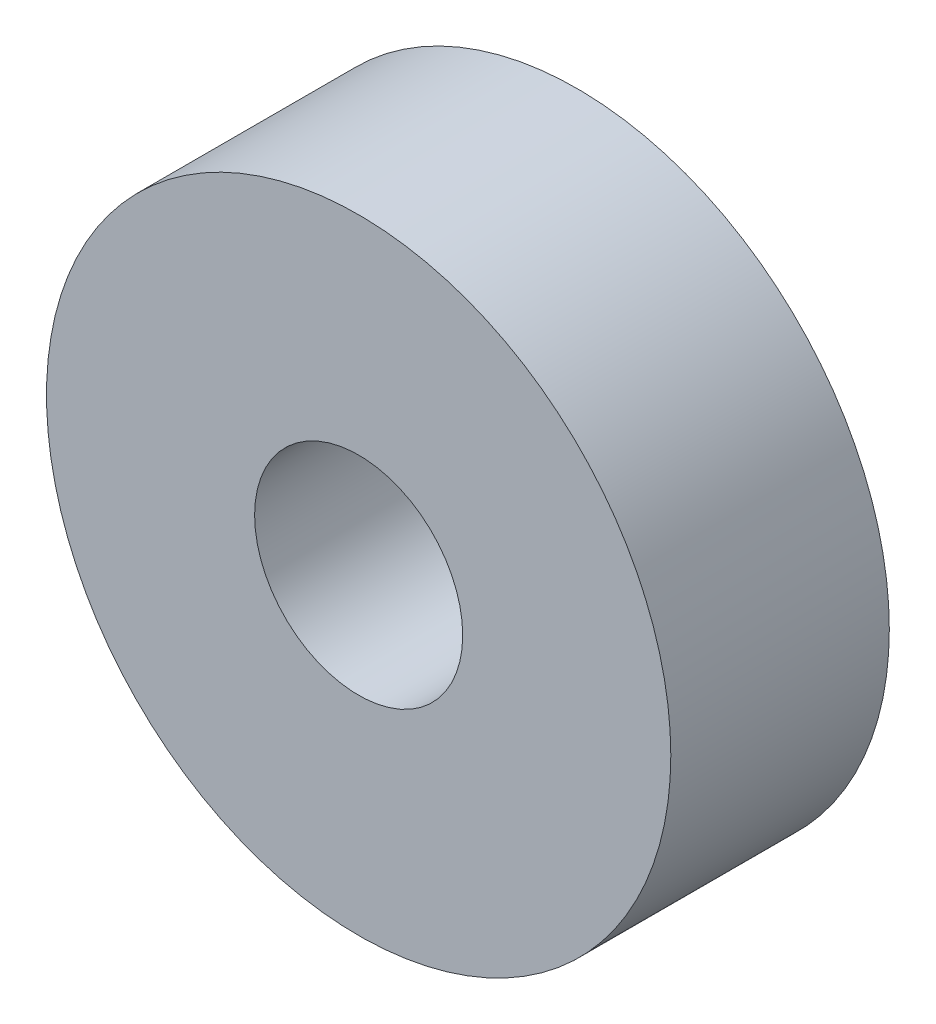
ISO-10303-21;
HEADER;
FILE_DESCRIPTION(('STEP AP214'),'2;1');
FILE_NAME('part.step','',(''),(''),'','','');
FILE_SCHEMA(('AUTOMOTIVE_DESIGN { 1 0 10303 214 1 1 1 1 }'));
ENDSEC;
DATA;
#1=APPLICATION_CONTEXT('core data for automotive mechanical design processes');
#2=APPLICATION_PROTOCOL_DEFINITION('international standard','automotive_design',2000,#1);
#3=PRODUCT_CONTEXT('',#1,'mechanical');
#4=PRODUCT('Part','Part','',(#3));
#5=PRODUCT_RELATED_PRODUCT_CATEGORY('part','',(#4));
#6=PRODUCT_DEFINITION_FORMATION('','',#4);
#7=PRODUCT_DEFINITION_CONTEXT('part definition',#1,'design');
#8=PRODUCT_DEFINITION('design','',#6,#7);
#9=PRODUCT_DEFINITION_SHAPE('','',#8);
#10=(LENGTH_UNIT() NAMED_UNIT(*) SI_UNIT(.MILLI.,.METRE.));
#11=(NAMED_UNIT(*) PLANE_ANGLE_UNIT() SI_UNIT($,.RADIAN.));
#12=(NAMED_UNIT(*) SI_UNIT($,.STERADIAN.) SOLID_ANGLE_UNIT());
#13=UNCERTAINTY_MEASURE_WITH_UNIT(LENGTH_MEASURE(1.E-05),#10,'distance_accuracy_value','');
#14=(GEOMETRIC_REPRESENTATION_CONTEXT(3) GLOBAL_UNCERTAINTY_ASSIGNED_CONTEXT((#13)) GLOBAL_UNIT_ASSIGNED_CONTEXT((#10,
#11,#12)) REPRESENTATION_CONTEXT('',''));
#15=CARTESIAN_POINT('',(0.,0.,0.));
#16=DIRECTION('',(0.,0.,1.));
#17=DIRECTION('',(1.,0.,0.));
#18=AXIS2_PLACEMENT_3D('',#15,#16,#17);
#19=CARTESIAN_POINT('',(0.,0.,10.5));
#20=DIRECTION('',(0.,0.,1.));
#21=DIRECTION('',(1.,0.,0.));
#22=AXIS2_PLACEMENT_3D('',#19,#20,#21);
#23=PLANE('',#22);
#24=CARTESIAN_POINT('',(0.,0.,10.5));
#25=DIRECTION('',(0.,0.,1.));
#26=DIRECTION('',(1.,0.,0.));
#27=AXIS2_PLACEMENT_3D('',#24,#25,#26);
#28=CIRCLE('',#27,15.);
#29=CARTESIAN_POINT('',(15.,0.,10.5));
#30=VERTEX_POINT('',#29);
#31=EDGE_CURVE('E10',#30,#30,#28,.T.);
#32=ORIENTED_EDGE('',*,*,#31,.T.);
#33=EDGE_LOOP('',(#32));
#34=FACE_BOUND('',#33,.T.);
#35=CARTESIAN_POINT('',(0.,0.,10.5));
#36=DIRECTION('',(0.,0.,1.));
#37=DIRECTION('',(1.,0.,0.));
#38=AXIS2_PLACEMENT_3D('',#35,#36,#37);
#39=CIRCLE('',#38,5.);
#40=CARTESIAN_POINT('',(5.,0.,10.5));
#41=VERTEX_POINT('',#40);
#42=EDGE_CURVE('E42',#41,#41,#39,.T.);
#43=ORIENTED_EDGE('',*,*,#42,.F.);
#44=EDGE_LOOP('',(#43));
#45=FACE_BOUND('',#44,.T.);
#46=ADVANCED_FACE('F31',(#34,#45),#23,.T.);
#47=CARTESIAN_POINT('',(0.,0.,0.));
#48=DIRECTION('',(0.,0.,1.));
#49=DIRECTION('',(1.,0.,0.));
#50=AXIS2_PLACEMENT_3D('',#47,#48,#49);
#51=PLANE('',#50);
#52=CARTESIAN_POINT('',(0.,0.,0.));
#53=DIRECTION('',(0.,0.,1.));
#54=DIRECTION('',(1.,0.,0.));
#55=AXIS2_PLACEMENT_3D('',#52,#53,#54);
#56=CIRCLE('',#55,15.);
#57=CARTESIAN_POINT('',(15.,0.,0.));
#58=VERTEX_POINT('',#57);
#59=EDGE_CURVE('E35',#58,#58,#56,.T.);
#60=ORIENTED_EDGE('',*,*,#59,.F.);
#61=EDGE_LOOP('',(#60));
#62=FACE_BOUND('',#61,.T.);
#63=CARTESIAN_POINT('',(0.,0.,0.));
#64=DIRECTION('',(0.,0.,1.));
#65=DIRECTION('',(1.,0.,0.));
#66=AXIS2_PLACEMENT_3D('',#63,#64,#65);
#67=CIRCLE('',#66,5.);
#68=CARTESIAN_POINT('',(5.,0.,0.));
#69=VERTEX_POINT('',#68);
#70=EDGE_CURVE('E44',#69,#69,#67,.T.);
#71=ORIENTED_EDGE('',*,*,#70,.T.);
#72=EDGE_LOOP('',(#71));
#73=FACE_BOUND('',#72,.T.);
#74=ADVANCED_FACE('F54',(#62,#73),#51,.F.);
#75=CARTESIAN_POINT('',(0.,0.,10.5));
#76=DIRECTION('',(0.,0.,-1.));
#77=DIRECTION('',(-1.,0.,0.));
#78=AXIS2_PLACEMENT_3D('',#75,#76,#77);
#79=CYLINDRICAL_SURFACE('',#78,15.);
#80=ORIENTED_EDGE('',*,*,#31,.F.);
#81=EDGE_LOOP('',(#80));
#82=FACE_BOUND('',#81,.T.);
#83=ORIENTED_EDGE('',*,*,#59,.T.);
#84=EDGE_LOOP('',(#83));
#85=FACE_BOUND('',#84,.T.);
#86=ADVANCED_FACE('F33',(#82,#85),#79,.T.);
#87=CARTESIAN_POINT('',(0.,0.,10.5));
#88=DIRECTION('',(0.,0.,-1.));
#89=DIRECTION('',(-1.,0.,0.));
#90=AXIS2_PLACEMENT_3D('',#87,#88,#89);
#91=CYLINDRICAL_SURFACE('',#90,5.);
#92=ORIENTED_EDGE('',*,*,#42,.T.);
#93=EDGE_LOOP('',(#92));
#94=FACE_BOUND('',#93,.T.);
#95=ORIENTED_EDGE('',*,*,#70,.F.);
#96=EDGE_LOOP('',(#95));
#97=FACE_BOUND('',#96,.T.);
#98=ADVANCED_FACE('F50',(#94,#97),#91,.F.);
#99=CLOSED_SHELL('',(#46,#74,#86,#98));
#100=MANIFOLD_SOLID_BREP('B2',#99);
#101=ADVANCED_BREP_SHAPE_REPRESENTATION('',(#18,#100),#14);
#102=SHAPE_DEFINITION_REPRESENTATION(#9,#101);
ENDSEC;
END-ISO-10303-21;
